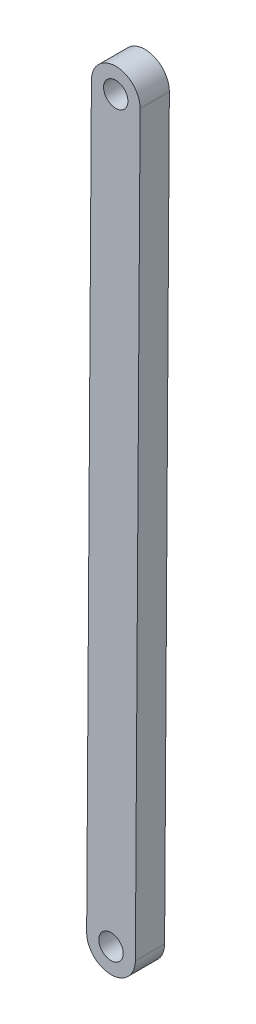
ISO-10303-21;
HEADER;
FILE_DESCRIPTION(('STEP AP214'),'2;1');
FILE_NAME('part.step','',(''),(''),'','','');
FILE_SCHEMA(('AUTOMOTIVE_DESIGN { 1 0 10303 214 1 1 1 1 }'));
ENDSEC;
DATA;
#1=APPLICATION_CONTEXT('core data for automotive mechanical design processes');
#2=APPLICATION_PROTOCOL_DEFINITION('international standard','automotive_design',2000,#1);
#3=PRODUCT_CONTEXT('',#1,'mechanical');
#4=PRODUCT('Part','Part','',(#3));
#5=PRODUCT_RELATED_PRODUCT_CATEGORY('part','',(#4));
#6=PRODUCT_DEFINITION_FORMATION('','',#4);
#7=PRODUCT_DEFINITION_CONTEXT('part definition',#1,'design');
#8=PRODUCT_DEFINITION('design','',#6,#7);
#9=PRODUCT_DEFINITION_SHAPE('','',#8);
#10=(LENGTH_UNIT() NAMED_UNIT(*) SI_UNIT(.MILLI.,.METRE.));
#11=(NAMED_UNIT(*) PLANE_ANGLE_UNIT() SI_UNIT($,.RADIAN.));
#12=(NAMED_UNIT(*) SI_UNIT($,.STERADIAN.) SOLID_ANGLE_UNIT());
#13=UNCERTAINTY_MEASURE_WITH_UNIT(LENGTH_MEASURE(1.E-05),#10,'distance_accuracy_value','');
#14=(GEOMETRIC_REPRESENTATION_CONTEXT(3) GLOBAL_UNCERTAINTY_ASSIGNED_CONTEXT((#13)) GLOBAL_UNIT_ASSIGNED_CONTEXT((#10,
#11,#12)) REPRESENTATION_CONTEXT('',''));
#15=CARTESIAN_POINT('',(0.,0.,0.));
#16=DIRECTION('',(0.,0.,1.));
#17=DIRECTION('',(1.,0.,0.));
#18=AXIS2_PLACEMENT_3D('',#15,#16,#17);
#19=CARTESIAN_POINT('',(0.,0.,12.));
#20=DIRECTION('',(0.,0.,1.));
#21=DIRECTION('',(1.,0.,0.));
#22=AXIS2_PLACEMENT_3D('',#19,#20,#21);
#23=PLANE('',#22);
#24=CARTESIAN_POINT('',(-1.94916067146284,-304.,12.));
#25=DIRECTION('',(0.,0.,1.));
#26=DIRECTION('',(1.,0.,0.));
#27=AXIS2_PLACEMENT_3D('',#24,#25,#26);
#28=CIRCLE('',#27,5.);
#29=CARTESIAN_POINT('',(3.05083932853717,-304.,12.));
#30=VERTEX_POINT('',#29);
#31=EDGE_CURVE('E100',#30,#30,#28,.T.);
#32=ORIENTED_EDGE('',*,*,#31,.F.);
#33=EDGE_LOOP('',(#32));
#34=FACE_BOUND('',#33,.T.);
#35=CARTESIAN_POINT('',(0.,0.,12.));
#36=DIRECTION('',(0.,0.,1.));
#37=DIRECTION('',(1.,0.,0.));
#38=AXIS2_PLACEMENT_3D('',#35,#36,#37);
#39=CIRCLE('',#38,9.99999999999999);
#40=CARTESIAN_POINT('',(9.99979445603642,-0.0641158094619023,12.));
#41=VERTEX_POINT('',#40);
#42=CARTESIAN_POINT('',(-9.99979445603642,0.0641158094619023,12.));
#43=VERTEX_POINT('',#42);
#44=EDGE_CURVE('E85',#41,#43,#39,.T.);
#45=ORIENTED_EDGE('',*,*,#44,.T.);
#46=DIRECTION('',(-0.00641158094619024,-0.999979445603644,0.));
#47=VECTOR('',#46,1.);
#48=CARTESIAN_POINT('',(-9.99979445603642,0.0641158094619023,12.));
#49=LINE('',#48,#47);
#50=CARTESIAN_POINT('',(-11.9489551274993,-303.935884190538,12.));
#51=VERTEX_POINT('',#50);
#52=EDGE_CURVE('E80',#43,#51,#49,.T.);
#53=ORIENTED_EDGE('',*,*,#52,.T.);
#54=CARTESIAN_POINT('',(-1.94916067146284,-304.,12.));
#55=DIRECTION('',(0.,0.,1.));
#56=DIRECTION('',(1.,0.,0.));
#57=AXIS2_PLACEMENT_3D('',#54,#55,#56);
#58=CIRCLE('',#57,9.99999999999999);
#59=CARTESIAN_POINT('',(8.05063378457359,-304.064115809462,12.));
#60=VERTEX_POINT('',#59);
#61=EDGE_CURVE('E83',#51,#60,#58,.T.);
#62=ORIENTED_EDGE('',*,*,#61,.T.);
#63=DIRECTION('',(0.00641158094619023,0.999979445603644,0.));
#64=VECTOR('',#63,1.);
#65=CARTESIAN_POINT('',(9.99979445603642,-0.0641158094619023,12.));
#66=LINE('',#65,#64);
#67=EDGE_CURVE('E50',#60,#41,#66,.T.);
#68=ORIENTED_EDGE('',*,*,#67,.T.);
#69=EDGE_LOOP('',(#45,#53,#62,#68));
#70=FACE_BOUND('',#69,.T.);
#71=CARTESIAN_POINT('',(0.,0.,12.));
#72=DIRECTION('',(0.,0.,1.));
#73=DIRECTION('',(1.,0.,0.));
#74=AXIS2_PLACEMENT_3D('',#71,#72,#73);
#75=CIRCLE('',#74,5.);
#76=CARTESIAN_POINT('',(5.,0.,12.));
#77=VERTEX_POINT('',#76);
#78=EDGE_CURVE('E115',#77,#77,#75,.T.);
#79=ORIENTED_EDGE('',*,*,#78,.F.);
#80=EDGE_LOOP('',(#79));
#81=FACE_BOUND('',#80,.T.);
#82=ADVANCED_FACE('F33',(#34,#70,#81),#23,.T.);
#83=CARTESIAN_POINT('',(0.,0.,0.));
#84=DIRECTION('',(0.,0.,1.));
#85=DIRECTION('',(1.,0.,0.));
#86=AXIS2_PLACEMENT_3D('',#83,#84,#85);
#87=PLANE('',#86);
#88=CARTESIAN_POINT('',(0.,0.,0.));
#89=DIRECTION('',(0.,0.,1.));
#90=DIRECTION('',(1.,0.,0.));
#91=AXIS2_PLACEMENT_3D('',#88,#89,#90);
#92=CIRCLE('',#91,9.99999999999999);
#93=CARTESIAN_POINT('',(9.99979445603642,-0.0641158094619023,0.));
#94=VERTEX_POINT('',#93);
#95=CARTESIAN_POINT('',(-9.99979445603642,0.0641158094619023,0.));
#96=VERTEX_POINT('',#95);
#97=EDGE_CURVE('E97',#94,#96,#92,.T.);
#98=ORIENTED_EDGE('',*,*,#97,.F.);
#99=DIRECTION('',(0.00641158094619023,0.999979445603644,0.));
#100=VECTOR('',#99,1.);
#101=CARTESIAN_POINT('',(9.99979445603642,-0.0641158094619023,0.));
#102=LINE('',#101,#100);
#103=CARTESIAN_POINT('',(8.05063378457359,-304.064115809462,0.));
#104=VERTEX_POINT('',#103);
#105=EDGE_CURVE('E73',#104,#94,#102,.T.);
#106=ORIENTED_EDGE('',*,*,#105,.F.);
#107=CARTESIAN_POINT('',(-1.94916067146284,-304.,0.));
#108=DIRECTION('',(0.,0.,1.));
#109=DIRECTION('',(1.,0.,0.));
#110=AXIS2_PLACEMENT_3D('',#107,#108,#109);
#111=CIRCLE('',#110,9.99999999999999);
#112=CARTESIAN_POINT('',(-11.9489551274993,-303.935884190538,0.));
#113=VERTEX_POINT('',#112);
#114=EDGE_CURVE('E67',#113,#104,#111,.T.);
#115=ORIENTED_EDGE('',*,*,#114,.F.);
#116=DIRECTION('',(-0.00641158094619024,-0.999979445603644,0.));
#117=VECTOR('',#116,1.);
#118=CARTESIAN_POINT('',(-9.99979445603642,0.0641158094619023,0.));
#119=LINE('',#118,#117);
#120=EDGE_CURVE('E89',#96,#113,#119,.T.);
#121=ORIENTED_EDGE('',*,*,#120,.F.);
#122=EDGE_LOOP('',(#98,#106,#115,#121));
#123=FACE_BOUND('',#122,.T.);
#124=CARTESIAN_POINT('',(-1.94916067146284,-304.,0.));
#125=DIRECTION('',(0.,0.,1.));
#126=DIRECTION('',(1.,0.,0.));
#127=AXIS2_PLACEMENT_3D('',#124,#125,#126);
#128=CIRCLE('',#127,5.);
#129=CARTESIAN_POINT('',(3.05083932853717,-304.,0.));
#130=VERTEX_POINT('',#129);
#131=EDGE_CURVE('E112',#130,#130,#128,.T.);
#132=ORIENTED_EDGE('',*,*,#131,.T.);
#133=EDGE_LOOP('',(#132));
#134=FACE_BOUND('',#133,.T.);
#135=CARTESIAN_POINT('',(0.,0.,0.));
#136=DIRECTION('',(0.,0.,1.));
#137=DIRECTION('',(1.,0.,0.));
#138=AXIS2_PLACEMENT_3D('',#135,#136,#137);
#139=CIRCLE('',#138,5.);
#140=CARTESIAN_POINT('',(5.,0.,0.));
#141=VERTEX_POINT('',#140);
#142=EDGE_CURVE('E118',#141,#141,#139,.T.);
#143=ORIENTED_EDGE('',*,*,#142,.T.);
#144=EDGE_LOOP('',(#143));
#145=FACE_BOUND('',#144,.T.);
#146=ADVANCED_FACE('F108',(#123,#134,#145),#87,.F.);
#147=CARTESIAN_POINT('',(0.,0.,12.));
#148=DIRECTION('',(0.,0.,-1.));
#149=DIRECTION('',(-1.,0.,0.));
#150=AXIS2_PLACEMENT_3D('',#147,#148,#149);
#151=CYLINDRICAL_SURFACE('',#150,9.99999999999999);
#152=ORIENTED_EDGE('',*,*,#97,.T.);
#153=DIRECTION('',(0.,0.,-1.));
#154=VECTOR('',#153,1.);
#155=CARTESIAN_POINT('',(-9.99979445603642,0.0641158094619023,12.));
#156=LINE('',#155,#154);
#157=EDGE_CURVE('E11',#43,#96,#156,.T.);
#158=ORIENTED_EDGE('',*,*,#157,.F.);
#159=ORIENTED_EDGE('',*,*,#44,.F.);
#160=DIRECTION('',(0.,0.,-1.));
#161=VECTOR('',#160,1.);
#162=CARTESIAN_POINT('',(9.99979445603642,-0.0641158094619023,12.));
#163=LINE('',#162,#161);
#164=EDGE_CURVE('E93',#41,#94,#163,.T.);
#165=ORIENTED_EDGE('',*,*,#164,.T.);
#166=EDGE_LOOP('',(#152,#158,#159,#165));
#167=FACE_BOUND('',#166,.T.);
#168=ADVANCED_FACE('F35',(#167),#151,.T.);
#169=CARTESIAN_POINT('',(-9.99979445603642,0.0641158094619023,12.));
#170=DIRECTION('',(0.999979445603644,-0.00641158094619024,0.));
#171=DIRECTION('',(0.00641158094619024,0.999979445603644,0.));
#172=AXIS2_PLACEMENT_3D('',#169,#170,#171);
#173=PLANE('',#172);
#174=ORIENTED_EDGE('',*,*,#120,.T.);
#175=DIRECTION('',(0.,0.,-1.));
#176=VECTOR('',#175,1.);
#177=CARTESIAN_POINT('',(-11.9489551274993,-303.935884190538,12.));
#178=LINE('',#177,#176);
#179=EDGE_CURVE('E42',#51,#113,#178,.T.);
#180=ORIENTED_EDGE('',*,*,#179,.F.);
#181=ORIENTED_EDGE('',*,*,#52,.F.);
#182=ORIENTED_EDGE('',*,*,#157,.T.);
#183=EDGE_LOOP('',(#174,#180,#181,#182));
#184=FACE_BOUND('',#183,.T.);
#185=ADVANCED_FACE('F88',(#184),#173,.F.);
#186=CARTESIAN_POINT('',(-1.94916067146284,-304.,12.));
#187=DIRECTION('',(0.,0.,-1.));
#188=DIRECTION('',(-1.,0.,0.));
#189=AXIS2_PLACEMENT_3D('',#186,#187,#188);
#190=CYLINDRICAL_SURFACE('',#189,9.99999999999999);
#191=ORIENTED_EDGE('',*,*,#114,.T.);
#192=DIRECTION('',(0.,0.,-1.));
#193=VECTOR('',#192,1.);
#194=CARTESIAN_POINT('',(8.05063378457359,-304.064115809462,12.));
#195=LINE('',#194,#193);
#196=EDGE_CURVE('E90',#60,#104,#195,.T.);
#197=ORIENTED_EDGE('',*,*,#196,.F.);
#198=ORIENTED_EDGE('',*,*,#61,.F.);
#199=ORIENTED_EDGE('',*,*,#179,.T.);
#200=EDGE_LOOP('',(#191,#197,#198,#199));
#201=FACE_BOUND('',#200,.T.);
#202=ADVANCED_FACE('F91',(#201),#190,.T.);
#203=CARTESIAN_POINT('',(9.99979445603642,-0.0641158094619023,12.));
#204=DIRECTION('',(-0.999979445603644,0.00641158094619023,0.));
#205=DIRECTION('',(-0.00641158094619023,-0.999979445603644,0.));
#206=AXIS2_PLACEMENT_3D('',#203,#204,#205);
#207=PLANE('',#206);
#208=ORIENTED_EDGE('',*,*,#105,.T.);
#209=ORIENTED_EDGE('',*,*,#164,.F.);
#210=ORIENTED_EDGE('',*,*,#67,.F.);
#211=ORIENTED_EDGE('',*,*,#196,.T.);
#212=EDGE_LOOP('',(#208,#209,#210,#211));
#213=FACE_BOUND('',#212,.T.);
#214=ADVANCED_FACE('F105',(#213),#207,.F.);
#215=CARTESIAN_POINT('',(-1.94916067146284,-304.,12.));
#216=DIRECTION('',(0.,0.,-1.));
#217=DIRECTION('',(-1.,0.,0.));
#218=AXIS2_PLACEMENT_3D('',#215,#216,#217);
#219=CYLINDRICAL_SURFACE('',#218,5.);
#220=ORIENTED_EDGE('',*,*,#31,.T.);
#221=EDGE_LOOP('',(#220));
#222=FACE_BOUND('',#221,.T.);
#223=ORIENTED_EDGE('',*,*,#131,.F.);
#224=EDGE_LOOP('',(#223));
#225=FACE_BOUND('',#224,.T.);
#226=ADVANCED_FACE('F135',(#222,#225),#219,.F.);
#227=CARTESIAN_POINT('',(0.,0.,12.));
#228=DIRECTION('',(0.,0.,-1.));
#229=DIRECTION('',(-1.,0.,0.));
#230=AXIS2_PLACEMENT_3D('',#227,#228,#229);
#231=CYLINDRICAL_SURFACE('',#230,5.);
#232=ORIENTED_EDGE('',*,*,#78,.T.);
#233=EDGE_LOOP('',(#232));
#234=FACE_BOUND('',#233,.T.);
#235=ORIENTED_EDGE('',*,*,#142,.F.);
#236=EDGE_LOOP('',(#235));
#237=FACE_BOUND('',#236,.T.);
#238=ADVANCED_FACE('F124',(#234,#237),#231,.F.);
#239=CLOSED_SHELL('',(#82,#146,#168,#185,#202,#214,#226,#238));
#240=MANIFOLD_SOLID_BREP('B2',#239);
#241=ADVANCED_BREP_SHAPE_REPRESENTATION('',(#18,#240),#14);
#242=SHAPE_DEFINITION_REPRESENTATION(#9,#241);
ENDSEC;
END-ISO-10303-21;
